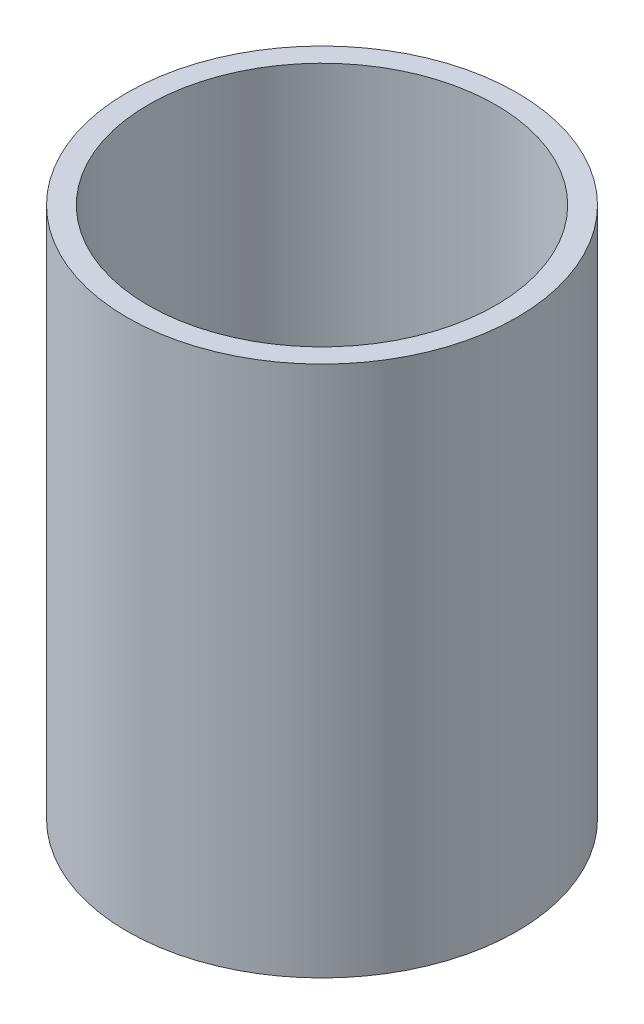
ISO-10303-21;
HEADER;
FILE_DESCRIPTION(('STEP AP214'),'2;1');
FILE_NAME('part.step','',(''),(''),'','','');
FILE_SCHEMA(('AUTOMOTIVE_DESIGN { 1 0 10303 214 1 1 1 1 }'));
ENDSEC;
DATA;
#1=APPLICATION_CONTEXT('core data for automotive mechanical design processes');
#2=APPLICATION_PROTOCOL_DEFINITION('international standard','automotive_design',2000,#1);
#3=PRODUCT_CONTEXT('',#1,'mechanical');
#4=PRODUCT('Part','Part','',(#3));
#5=PRODUCT_RELATED_PRODUCT_CATEGORY('part','',(#4));
#6=PRODUCT_DEFINITION_FORMATION('','',#4);
#7=PRODUCT_DEFINITION_CONTEXT('part definition',#1,'design');
#8=PRODUCT_DEFINITION('design','',#6,#7);
#9=PRODUCT_DEFINITION_SHAPE('','',#8);
#10=(LENGTH_UNIT() NAMED_UNIT(*) SI_UNIT(.MILLI.,.METRE.));
#11=(NAMED_UNIT(*) PLANE_ANGLE_UNIT() SI_UNIT($,.RADIAN.));
#12=(NAMED_UNIT(*) SI_UNIT($,.STERADIAN.) SOLID_ANGLE_UNIT());
#13=UNCERTAINTY_MEASURE_WITH_UNIT(LENGTH_MEASURE(1.E-05),#10,'distance_accuracy_value','');
#14=(GEOMETRIC_REPRESENTATION_CONTEXT(3) GLOBAL_UNCERTAINTY_ASSIGNED_CONTEXT((#13)) GLOBAL_UNIT_ASSIGNED_CONTEXT((#10,
#11,#12)) REPRESENTATION_CONTEXT('',''));
#15=CARTESIAN_POINT('',(0.,0.,0.));
#16=DIRECTION('',(0.,0.,1.));
#17=DIRECTION('',(1.,0.,0.));
#18=AXIS2_PLACEMENT_3D('',#15,#16,#17);
#19=CARTESIAN_POINT('',(0.,156.91185860467,0.));
#20=DIRECTION('',(0.,-1.,0.));
#21=DIRECTION('',(0.,0.,-1.));
#22=AXIS2_PLACEMENT_3D('',#19,#20,#21);
#23=CYLINDRICAL_SURFACE('',#22,57.5);
#24=CARTESIAN_POINT('',(0.,156.91185860467,0.));
#25=DIRECTION('',(0.,1.,0.));
#26=DIRECTION('',(0.,0.,1.));
#27=AXIS2_PLACEMENT_3D('',#24,#25,#26);
#28=CIRCLE('',#27,57.5);
#29=CARTESIAN_POINT('',(0.,156.91185860467,57.5));
#30=VERTEX_POINT('',#29);
#31=EDGE_CURVE('E10',#30,#30,#28,.T.);
#32=ORIENTED_EDGE('',*,*,#31,.F.);
#33=EDGE_LOOP('',(#32));
#34=FACE_BOUND('',#33,.T.);
#35=CARTESIAN_POINT('',(0.,0.,0.));
#36=DIRECTION('',(0.,1.,0.));
#37=DIRECTION('',(0.,0.,1.));
#38=AXIS2_PLACEMENT_3D('',#35,#36,#37);
#39=CIRCLE('',#38,57.5);
#40=CARTESIAN_POINT('',(0.,0.,57.5));
#41=VERTEX_POINT('',#40);
#42=EDGE_CURVE('E37',#41,#41,#39,.T.);
#43=ORIENTED_EDGE('',*,*,#42,.T.);
#44=EDGE_LOOP('',(#43));
#45=FACE_BOUND('',#44,.T.);
#46=ADVANCED_FACE('F40',(#34,#45),#23,.T.);
#47=CARTESIAN_POINT('',(0.,156.91185860467,0.));
#48=DIRECTION('',(0.,1.,0.));
#49=DIRECTION('',(0.,0.,1.));
#50=AXIS2_PLACEMENT_3D('',#47,#48,#49);
#51=PLANE('',#50);
#52=CARTESIAN_POINT('',(0.,156.91185860467,0.));
#53=DIRECTION('',(0.,1.,0.));
#54=DIRECTION('',(0.,0.,1.));
#55=AXIS2_PLACEMENT_3D('',#52,#53,#54);
#56=CIRCLE('',#55,51.2815965942622);
#57=CARTESIAN_POINT('',(0.,156.91185860467,51.2815965942622));
#58=VERTEX_POINT('',#57);
#59=EDGE_CURVE('E50',#58,#58,#56,.T.);
#60=ORIENTED_EDGE('',*,*,#59,.F.);
#61=EDGE_LOOP('',(#60));
#62=FACE_BOUND('',#61,.T.);
#63=ORIENTED_EDGE('',*,*,#31,.T.);
#64=EDGE_LOOP('',(#63));
#65=FACE_BOUND('',#64,.T.);
#66=ADVANCED_FACE('F59',(#62,#65),#51,.T.);
#67=CARTESIAN_POINT('',(0.,0.,0.));
#68=DIRECTION('',(0.,1.,0.));
#69=DIRECTION('',(0.,0.,1.));
#70=AXIS2_PLACEMENT_3D('',#67,#68,#69);
#71=PLANE('',#70);
#72=CARTESIAN_POINT('',(0.,0.,0.));
#73=DIRECTION('',(0.,1.,0.));
#74=DIRECTION('',(0.,0.,1.));
#75=AXIS2_PLACEMENT_3D('',#72,#73,#74);
#76=CIRCLE('',#75,51.2815965942622);
#77=CARTESIAN_POINT('',(0.,0.,51.2815965942622));
#78=VERTEX_POINT('',#77);
#79=EDGE_CURVE('E47',#78,#78,#76,.T.);
#80=ORIENTED_EDGE('',*,*,#79,.T.);
#81=EDGE_LOOP('',(#80));
#82=FACE_BOUND('',#81,.T.);
#83=ORIENTED_EDGE('',*,*,#42,.F.);
#84=EDGE_LOOP('',(#83));
#85=FACE_BOUND('',#84,.T.);
#86=ADVANCED_FACE('F58',(#82,#85),#71,.F.);
#87=CARTESIAN_POINT('',(0.,156.91185860467,0.));
#88=DIRECTION('',(0.,-1.,0.));
#89=DIRECTION('',(0.,0.,-1.));
#90=AXIS2_PLACEMENT_3D('',#87,#88,#89);
#91=CYLINDRICAL_SURFACE('',#90,51.2815965942622);
#92=ORIENTED_EDGE('',*,*,#59,.T.);
#93=EDGE_LOOP('',(#92));
#94=FACE_BOUND('',#93,.T.);
#95=ORIENTED_EDGE('',*,*,#79,.F.);
#96=EDGE_LOOP('',(#95));
#97=FACE_BOUND('',#96,.T.);
#98=ADVANCED_FACE('F54',(#94,#97),#91,.F.);
#99=CLOSED_SHELL('',(#46,#66,#86,#98));
#100=MANIFOLD_SOLID_BREP('B2',#99);
#101=ADVANCED_BREP_SHAPE_REPRESENTATION('',(#18,#100),#14);
#102=SHAPE_DEFINITION_REPRESENTATION(#9,#101);
ENDSEC;
END-ISO-10303-21;
